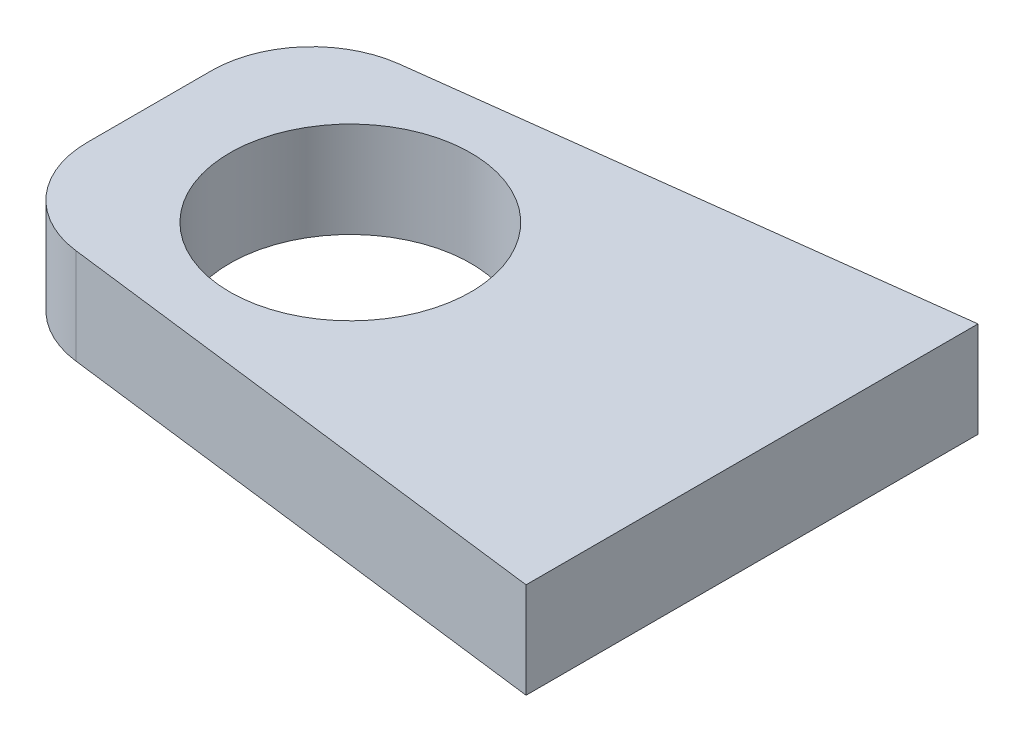
ISO-10303-21;
HEADER;
FILE_DESCRIPTION(('STEP AP214'),'2;1');
FILE_NAME('part.step','',(''),(''),'','','');
FILE_SCHEMA(('AUTOMOTIVE_DESIGN { 1 0 10303 214 1 1 1 1 }'));
ENDSEC;
DATA;
#1=APPLICATION_CONTEXT('core data for automotive mechanical design processes');
#2=APPLICATION_PROTOCOL_DEFINITION('international standard','automotive_design',2000,#1);
#3=PRODUCT_CONTEXT('',#1,'mechanical');
#4=PRODUCT('Part','Part','',(#3));
#5=PRODUCT_RELATED_PRODUCT_CATEGORY('part','',(#4));
#6=PRODUCT_DEFINITION_FORMATION('','',#4);
#7=PRODUCT_DEFINITION_CONTEXT('part definition',#1,'design');
#8=PRODUCT_DEFINITION('design','',#6,#7);
#9=PRODUCT_DEFINITION_SHAPE('','',#8);
#10=(LENGTH_UNIT() NAMED_UNIT(*) SI_UNIT(.MILLI.,.METRE.));
#11=(NAMED_UNIT(*) PLANE_ANGLE_UNIT() SI_UNIT($,.RADIAN.));
#12=(NAMED_UNIT(*) SI_UNIT($,.STERADIAN.) SOLID_ANGLE_UNIT());
#13=UNCERTAINTY_MEASURE_WITH_UNIT(LENGTH_MEASURE(1.E-05),#10,'distance_accuracy_value','');
#14=(GEOMETRIC_REPRESENTATION_CONTEXT(3) GLOBAL_UNCERTAINTY_ASSIGNED_CONTEXT((#13)) GLOBAL_UNIT_ASSIGNED_CONTEXT((#10,
#11,#12)) REPRESENTATION_CONTEXT('',''));
#15=CARTESIAN_POINT('',(0.,0.,0.));
#16=DIRECTION('',(0.,0.,1.));
#17=DIRECTION('',(1.,0.,0.));
#18=AXIS2_PLACEMENT_3D('',#15,#16,#17);
#19=CARTESIAN_POINT('',(0.,4.7625,0.));
#20=DIRECTION('',(0.,1.,0.));
#21=DIRECTION('',(0.,0.,1.));
#22=AXIS2_PLACEMENT_3D('',#19,#20,#21);
#23=PLANE('',#22);
#24=DIRECTION('',(0.,0.,1.));
#25=VECTOR('',#24,1.);
#26=CARTESIAN_POINT('',(-30.,4.7625,-7.5));
#27=LINE('',#26,#25);
#28=CARTESIAN_POINT('',(-30.,4.7625,-3.08608890731341));
#29=VERTEX_POINT('',#28);
#30=CARTESIAN_POINT('',(-30.,4.7625,3.08608890731341));
#31=VERTEX_POINT('',#30);
#32=EDGE_CURVE('E101',#29,#31,#27,.T.);
#33=ORIENTED_EDGE('',*,*,#32,.T.);
#34=CARTESIAN_POINT('',(-25.,4.7625,3.08608890731341));
#35=DIRECTION('',(0.,1.,0.));
#36=DIRECTION('',(0.,0.,1.));
#37=AXIS2_PLACEMENT_3D('',#34,#35,#36);
#38=CIRCLE('',#37,5.);
#39=CARTESIAN_POINT('',(-25.620173672946,4.7625,8.04747829088174));
#40=VERTEX_POINT('',#39);
#41=EDGE_CURVE('E45',#31,#40,#38,.T.);
#42=ORIENTED_EDGE('',*,*,#41,.T.);
#43=DIRECTION('',(0.992277876713668,0.,0.124034734589208));
#44=VECTOR('',#43,1.);
#45=CARTESIAN_POINT('',(-30.,4.7625,7.5));
#46=LINE('',#45,#44);
#47=CARTESIAN_POINT('',(0.,4.7625,11.25));
#48=VERTEX_POINT('',#47);
#49=EDGE_CURVE('E91',#40,#48,#46,.T.);
#50=ORIENTED_EDGE('',*,*,#49,.T.);
#51=DIRECTION('',(0.,0.,-1.));
#52=VECTOR('',#51,1.);
#53=CARTESIAN_POINT('',(0.,4.7625,11.25));
#54=LINE('',#53,#52);
#55=CARTESIAN_POINT('',(0.,4.7625,-11.25));
#56=VERTEX_POINT('',#55);
#57=EDGE_CURVE('E95',#48,#56,#54,.T.);
#58=ORIENTED_EDGE('',*,*,#57,.T.);
#59=DIRECTION('',(-0.992277876713668,0.,0.124034734589208));
#60=VECTOR('',#59,1.);
#61=CARTESIAN_POINT('',(0.,4.7625,-11.25));
#62=LINE('',#61,#60);
#63=CARTESIAN_POINT('',(-25.620173672946,4.7625,-8.04747829088175));
#64=VERTEX_POINT('',#63);
#65=EDGE_CURVE('E126',#56,#64,#62,.T.);
#66=ORIENTED_EDGE('',*,*,#65,.T.);
#67=CARTESIAN_POINT('',(-25.,4.7625,-3.08608890731341));
#68=DIRECTION('',(0.,1.,0.));
#69=DIRECTION('',(0.,0.,1.));
#70=AXIS2_PLACEMENT_3D('',#67,#68,#69);
#71=CIRCLE('',#70,5.);
#72=EDGE_CURVE('E137',#64,#29,#71,.T.);
#73=ORIENTED_EDGE('',*,*,#72,.T.);
#74=EDGE_LOOP('',(#33,#42,#50,#58,#66,#73));
#75=FACE_BOUND('',#74,.T.);
#76=CARTESIAN_POINT('',(-20.,4.7625,0.));
#77=DIRECTION('',(0.,1.,0.));
#78=DIRECTION('',(0.,0.,1.));
#79=AXIS2_PLACEMENT_3D('',#76,#77,#78);
#80=CIRCLE('',#79,5.99999999999999);
#81=CARTESIAN_POINT('',(-20.,4.7625,5.99999999999999));
#82=VERTEX_POINT('',#81);
#83=EDGE_CURVE('E122',#82,#82,#80,.T.);
#84=ORIENTED_EDGE('',*,*,#83,.F.);
#85=EDGE_LOOP('',(#84));
#86=FACE_BOUND('',#85,.T.);
#87=ADVANCED_FACE('F37',(#75,#86),#23,.T.);
#88=CARTESIAN_POINT('',(0.,0.,0.));
#89=DIRECTION('',(0.,1.,0.));
#90=DIRECTION('',(0.,0.,1.));
#91=AXIS2_PLACEMENT_3D('',#88,#89,#90);
#92=PLANE('',#91);
#93=DIRECTION('',(0.992277876713668,0.,0.124034734589208));
#94=VECTOR('',#93,1.);
#95=CARTESIAN_POINT('',(-30.,0.,7.5));
#96=LINE('',#95,#94);
#97=CARTESIAN_POINT('',(-25.620173672946,0.,8.04747829088174));
#98=VERTEX_POINT('',#97);
#99=CARTESIAN_POINT('',(0.,0.,11.25));
#100=VERTEX_POINT('',#99);
#101=EDGE_CURVE('E107',#98,#100,#96,.T.);
#102=ORIENTED_EDGE('',*,*,#101,.F.);
#103=CARTESIAN_POINT('',(-25.,0.,3.08608890731341));
#104=DIRECTION('',(0.,1.,0.));
#105=DIRECTION('',(0.,0.,1.));
#106=AXIS2_PLACEMENT_3D('',#103,#104,#105);
#107=CIRCLE('',#106,5.);
#108=CARTESIAN_POINT('',(-30.,0.,3.08608890731341));
#109=VERTEX_POINT('',#108);
#110=EDGE_CURVE('E131',#98,#109,#107,.F.);
#111=ORIENTED_EDGE('',*,*,#110,.T.);
#112=DIRECTION('',(0.,0.,1.));
#113=VECTOR('',#112,1.);
#114=CARTESIAN_POINT('',(-30.,0.,-7.5));
#115=LINE('',#114,#113);
#116=CARTESIAN_POINT('',(-30.,0.,-3.08608890731341));
#117=VERTEX_POINT('',#116);
#118=EDGE_CURVE('E121',#117,#109,#115,.T.);
#119=ORIENTED_EDGE('',*,*,#118,.F.);
#120=CARTESIAN_POINT('',(-25.,0.,-3.08608890731341));
#121=DIRECTION('',(0.,1.,0.));
#122=DIRECTION('',(0.,0.,1.));
#123=AXIS2_PLACEMENT_3D('',#120,#121,#122);
#124=CIRCLE('',#123,5.);
#125=CARTESIAN_POINT('',(-25.620173672946,0.,-8.04747829088175));
#126=VERTEX_POINT('',#125);
#127=EDGE_CURVE('E129',#117,#126,#124,.F.);
#128=ORIENTED_EDGE('',*,*,#127,.T.);
#129=DIRECTION('',(-0.992277876713668,0.,0.124034734589208));
#130=VECTOR('',#129,1.);
#131=CARTESIAN_POINT('',(0.,0.,-11.25));
#132=LINE('',#131,#130);
#133=CARTESIAN_POINT('',(0.,0.,-11.25));
#134=VERTEX_POINT('',#133);
#135=EDGE_CURVE('E119',#134,#126,#132,.T.);
#136=ORIENTED_EDGE('',*,*,#135,.F.);
#137=DIRECTION('',(0.,0.,-1.));
#138=VECTOR('',#137,1.);
#139=CARTESIAN_POINT('',(0.,0.,11.25));
#140=LINE('',#139,#138);
#141=EDGE_CURVE('E125',#100,#134,#140,.T.);
#142=ORIENTED_EDGE('',*,*,#141,.F.);
#143=EDGE_LOOP('',(#102,#111,#119,#128,#136,#142));
#144=FACE_BOUND('',#143,.T.);
#145=CARTESIAN_POINT('',(-20.,0.,0.));
#146=DIRECTION('',(0.,1.,0.));
#147=DIRECTION('',(0.,0.,1.));
#148=AXIS2_PLACEMENT_3D('',#145,#146,#147);
#149=CIRCLE('',#148,5.99999999999999);
#150=CARTESIAN_POINT('',(-20.,0.,5.99999999999999));
#151=VERTEX_POINT('',#150);
#152=EDGE_CURVE('E150',#151,#151,#149,.T.);
#153=ORIENTED_EDGE('',*,*,#152,.T.);
#154=EDGE_LOOP('',(#153));
#155=FACE_BOUND('',#154,.T.);
#156=ADVANCED_FACE('F145',(#144,#155),#92,.F.);
#157=CARTESIAN_POINT('',(0.,4.7625,-11.25));
#158=DIRECTION('',(0.124034734589208,0.,0.992277876713668));
#159=DIRECTION('',(0.992277876713668,0.,-0.124034734589208));
#160=AXIS2_PLACEMENT_3D('',#157,#158,#159);
#161=PLANE('',#160);
#162=ORIENTED_EDGE('',*,*,#135,.T.);
#163=DIRECTION('',(0.,-1.,0.));
#164=VECTOR('',#163,1.);
#165=CARTESIAN_POINT('',(-25.620173672946,4.7625,-8.04747829088175));
#166=LINE('',#165,#164);
#167=EDGE_CURVE('E11',#126,#64,#166,.F.);
#168=ORIENTED_EDGE('',*,*,#167,.T.);
#169=ORIENTED_EDGE('',*,*,#65,.F.);
#170=DIRECTION('',(0.,-1.,0.));
#171=VECTOR('',#170,1.);
#172=CARTESIAN_POINT('',(0.,4.7625,-11.25));
#173=LINE('',#172,#171);
#174=EDGE_CURVE('E111',#56,#134,#173,.T.);
#175=ORIENTED_EDGE('',*,*,#174,.T.);
#176=EDGE_LOOP('',(#162,#168,#169,#175));
#177=FACE_BOUND('',#176,.T.);
#178=ADVANCED_FACE('F147',(#177),#161,.F.);
#179=CARTESIAN_POINT('',(-30.,4.7625,-7.5));
#180=DIRECTION('',(1.,0.,0.));
#181=DIRECTION('',(0.,0.,-1.));
#182=AXIS2_PLACEMENT_3D('',#179,#180,#181);
#183=PLANE('',#182);
#184=ORIENTED_EDGE('',*,*,#118,.T.);
#185=DIRECTION('',(0.,-1.,0.));
#186=VECTOR('',#185,1.);
#187=CARTESIAN_POINT('',(-30.,4.7625,3.08608890731341));
#188=LINE('',#187,#186);
#189=EDGE_CURVE('E58',#109,#31,#188,.F.);
#190=ORIENTED_EDGE('',*,*,#189,.T.);
#191=ORIENTED_EDGE('',*,*,#32,.F.);
#192=DIRECTION('',(0.,-1.,0.));
#193=VECTOR('',#192,1.);
#194=CARTESIAN_POINT('',(-30.,4.7625,-3.08608890731341));
#195=LINE('',#194,#193);
#196=EDGE_CURVE('E133',#29,#117,#195,.T.);
#197=ORIENTED_EDGE('',*,*,#196,.T.);
#198=EDGE_LOOP('',(#184,#190,#191,#197));
#199=FACE_BOUND('',#198,.T.);
#200=ADVANCED_FACE('F141',(#199),#183,.F.);
#201=CARTESIAN_POINT('',(-30.,4.7625,7.5));
#202=DIRECTION('',(0.124034734589208,0.,-0.992277876713668));
#203=DIRECTION('',(-0.992277876713668,0.,-0.124034734589208));
#204=AXIS2_PLACEMENT_3D('',#201,#202,#203);
#205=PLANE('',#204);
#206=ORIENTED_EDGE('',*,*,#49,.F.);
#207=DIRECTION('',(0.,-1.,0.));
#208=VECTOR('',#207,1.);
#209=CARTESIAN_POINT('',(-25.620173672946,4.7625,8.04747829088174));
#210=LINE('',#209,#208);
#211=EDGE_CURVE('E110',#40,#98,#210,.T.);
#212=ORIENTED_EDGE('',*,*,#211,.T.);
#213=ORIENTED_EDGE('',*,*,#101,.T.);
#214=DIRECTION('',(0.,-1.,0.));
#215=VECTOR('',#214,1.);
#216=CARTESIAN_POINT('',(0.,4.7625,11.25));
#217=LINE('',#216,#215);
#218=EDGE_CURVE('E104',#48,#100,#217,.T.);
#219=ORIENTED_EDGE('',*,*,#218,.F.);
#220=EDGE_LOOP('',(#206,#212,#213,#219));
#221=FACE_BOUND('',#220,.T.);
#222=ADVANCED_FACE('F105',(#221),#205,.F.);
#223=CARTESIAN_POINT('',(0.,4.7625,11.25));
#224=DIRECTION('',(-1.,0.,0.));
#225=DIRECTION('',(0.,0.,1.));
#226=AXIS2_PLACEMENT_3D('',#223,#224,#225);
#227=PLANE('',#226);
#228=ORIENTED_EDGE('',*,*,#141,.T.);
#229=ORIENTED_EDGE('',*,*,#174,.F.);
#230=ORIENTED_EDGE('',*,*,#57,.F.);
#231=ORIENTED_EDGE('',*,*,#218,.T.);
#232=EDGE_LOOP('',(#228,#229,#230,#231));
#233=FACE_BOUND('',#232,.T.);
#234=ADVANCED_FACE('F113',(#233),#227,.F.);
#235=CARTESIAN_POINT('',(-20.,4.7625,0.));
#236=DIRECTION('',(0.,-1.,0.));
#237=DIRECTION('',(0.,0.,-1.));
#238=AXIS2_PLACEMENT_3D('',#235,#236,#237);
#239=CYLINDRICAL_SURFACE('',#238,5.99999999999999);
#240=ORIENTED_EDGE('',*,*,#83,.T.);
#241=EDGE_LOOP('',(#240));
#242=FACE_BOUND('',#241,.T.);
#243=ORIENTED_EDGE('',*,*,#152,.F.);
#244=EDGE_LOOP('',(#243));
#245=FACE_BOUND('',#244,.T.);
#246=ADVANCED_FACE('F156',(#242,#245),#239,.F.);
#247=CARTESIAN_POINT('',(-25.,4.7625,3.08608890731341));
#248=DIRECTION('',(0.,-1.,0.));
#249=DIRECTION('',(0.,0.,-1.));
#250=AXIS2_PLACEMENT_3D('',#247,#248,#249);
#251=CYLINDRICAL_SURFACE('',#250,5.);
#252=ORIENTED_EDGE('',*,*,#41,.F.);
#253=ORIENTED_EDGE('',*,*,#189,.F.);
#254=ORIENTED_EDGE('',*,*,#110,.F.);
#255=ORIENTED_EDGE('',*,*,#211,.F.);
#256=EDGE_LOOP('',(#252,#253,#254,#255));
#257=FACE_BOUND('',#256,.T.);
#258=ADVANCED_FACE('F173',(#257),#251,.T.);
#259=CARTESIAN_POINT('',(-25.,4.7625,-3.08608890731341));
#260=DIRECTION('',(0.,-1.,0.));
#261=DIRECTION('',(0.,0.,-1.));
#262=AXIS2_PLACEMENT_3D('',#259,#260,#261);
#263=CYLINDRICAL_SURFACE('',#262,5.);
#264=ORIENTED_EDGE('',*,*,#72,.F.);
#265=ORIENTED_EDGE('',*,*,#167,.F.);
#266=ORIENTED_EDGE('',*,*,#127,.F.);
#267=ORIENTED_EDGE('',*,*,#196,.F.);
#268=EDGE_LOOP('',(#264,#265,#266,#267));
#269=FACE_BOUND('',#268,.T.);
#270=ADVANCED_FACE('F39',(#269),#263,.T.);
#271=CLOSED_SHELL('',(#87,#156,#178,#200,#222,#234,#246,#258,#270));
#272=MANIFOLD_SOLID_BREP('B2',#271);
#273=ADVANCED_BREP_SHAPE_REPRESENTATION('',(#18,#272),#14);
#274=SHAPE_DEFINITION_REPRESENTATION(#9,#273);
ENDSEC;
END-ISO-10303-21;
